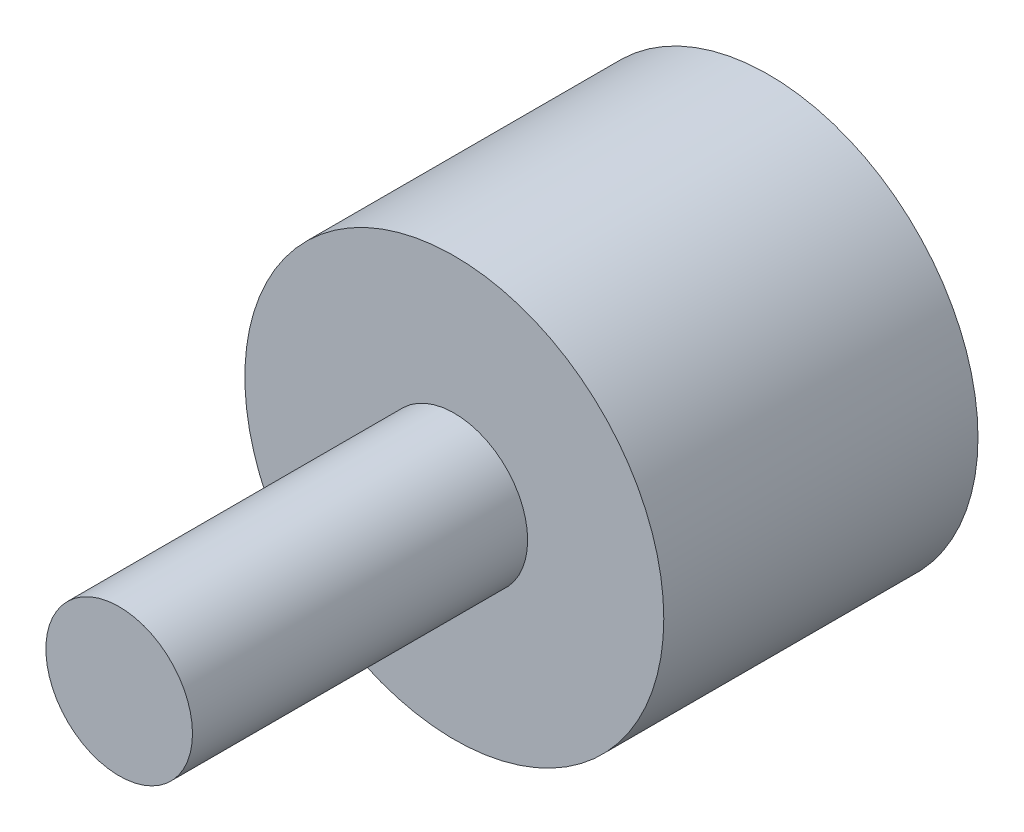
ISO-10303-21;
HEADER;
FILE_DESCRIPTION(('STEP AP214'),'2;1');
FILE_NAME('part.step','',(''),(''),'','','');
FILE_SCHEMA(('AUTOMOTIVE_DESIGN { 1 0 10303 214 1 1 1 1 }'));
ENDSEC;
DATA;
#1=APPLICATION_CONTEXT('core data for automotive mechanical design processes');
#2=APPLICATION_PROTOCOL_DEFINITION('international standard','automotive_design',2000,#1);
#3=PRODUCT_CONTEXT('',#1,'mechanical');
#4=PRODUCT('Part','Part','',(#3));
#5=PRODUCT_RELATED_PRODUCT_CATEGORY('part','',(#4));
#6=PRODUCT_DEFINITION_FORMATION('','',#4);
#7=PRODUCT_DEFINITION_CONTEXT('part definition',#1,'design');
#8=PRODUCT_DEFINITION('design','',#6,#7);
#9=PRODUCT_DEFINITION_SHAPE('','',#8);
#10=(LENGTH_UNIT() NAMED_UNIT(*) SI_UNIT(.MILLI.,.METRE.));
#11=(NAMED_UNIT(*) PLANE_ANGLE_UNIT() SI_UNIT($,.RADIAN.));
#12=(NAMED_UNIT(*) SI_UNIT($,.STERADIAN.) SOLID_ANGLE_UNIT());
#13=UNCERTAINTY_MEASURE_WITH_UNIT(LENGTH_MEASURE(1.E-05),#10,'distance_accuracy_value','');
#14=(GEOMETRIC_REPRESENTATION_CONTEXT(3) GLOBAL_UNCERTAINTY_ASSIGNED_CONTEXT((#13)) GLOBAL_UNIT_ASSIGNED_CONTEXT((#10,
#11,#12)) REPRESENTATION_CONTEXT('',''));
#15=CARTESIAN_POINT('',(0.,0.,0.));
#16=DIRECTION('',(0.,0.,1.));
#17=DIRECTION('',(1.,0.,0.));
#18=AXIS2_PLACEMENT_3D('',#15,#16,#17);
#19=CARTESIAN_POINT('',(0.,0.,15.));
#20=DIRECTION('',(0.,0.,-1.));
#21=DIRECTION('',(-1.,0.,0.));
#22=AXIS2_PLACEMENT_3D('',#19,#20,#21);
#23=CYLINDRICAL_SURFACE('',#22,10.);
#24=CARTESIAN_POINT('',(0.,0.,15.));
#25=DIRECTION('',(0.,0.,1.));
#26=DIRECTION('',(1.,0.,0.));
#27=AXIS2_PLACEMENT_3D('',#24,#25,#26);
#28=CIRCLE('',#27,10.);
#29=CARTESIAN_POINT('',(10.,0.,15.));
#30=VERTEX_POINT('',#29);
#31=EDGE_CURVE('E10',#30,#30,#28,.T.);
#32=ORIENTED_EDGE('',*,*,#31,.F.);
#33=EDGE_LOOP('',(#32));
#34=FACE_BOUND('',#33,.T.);
#35=CARTESIAN_POINT('',(0.,0.,0.));
#36=DIRECTION('',(0.,0.,1.));
#37=DIRECTION('',(1.,0.,0.));
#38=AXIS2_PLACEMENT_3D('',#35,#36,#37);
#39=CIRCLE('',#38,10.);
#40=CARTESIAN_POINT('',(10.,0.,0.));
#41=VERTEX_POINT('',#40);
#42=EDGE_CURVE('E40',#41,#41,#39,.T.);
#43=ORIENTED_EDGE('',*,*,#42,.T.);
#44=EDGE_LOOP('',(#43));
#45=FACE_BOUND('',#44,.T.);
#46=ADVANCED_FACE('F33',(#34,#45),#23,.T.);
#47=CARTESIAN_POINT('',(0.,0.,15.));
#48=DIRECTION('',(0.,0.,1.));
#49=DIRECTION('',(1.,0.,0.));
#50=AXIS2_PLACEMENT_3D('',#47,#48,#49);
#51=PLANE('',#50);
#52=CARTESIAN_POINT('',(0.,0.,15.));
#53=DIRECTION('',(0.,0.,1.));
#54=DIRECTION('',(1.,0.,0.));
#55=AXIS2_PLACEMENT_3D('',#52,#53,#54);
#56=CIRCLE('',#55,3.5);
#57=CARTESIAN_POINT('',(3.5,0.,15.));
#58=VERTEX_POINT('',#57);
#59=EDGE_CURVE('E47',#58,#58,#56,.T.);
#60=ORIENTED_EDGE('',*,*,#59,.F.);
#61=EDGE_LOOP('',(#60));
#62=FACE_BOUND('',#61,.T.);
#63=ORIENTED_EDGE('',*,*,#31,.T.);
#64=EDGE_LOOP('',(#63));
#65=FACE_BOUND('',#64,.T.);
#66=ADVANCED_FACE('F62',(#62,#65),#51,.T.);
#67=CARTESIAN_POINT('',(0.,0.,0.));
#68=DIRECTION('',(0.,0.,1.));
#69=DIRECTION('',(1.,0.,0.));
#70=AXIS2_PLACEMENT_3D('',#67,#68,#69);
#71=PLANE('',#70);
#72=CARTESIAN_POINT('',(0.,0.,0.));
#73=DIRECTION('',(0.,0.,1.));
#74=DIRECTION('',(1.,0.,0.));
#75=AXIS2_PLACEMENT_3D('',#72,#73,#74);
#76=CIRCLE('',#75,5.19615242270663);
#77=CARTESIAN_POINT('',(5.19615242270663,0.,0.));
#78=VERTEX_POINT('',#77);
#79=EDGE_CURVE('E36',#78,#78,#76,.T.);
#80=ORIENTED_EDGE('',*,*,#79,.T.);
#81=EDGE_LOOP('',(#80));
#82=FACE_BOUND('',#81,.T.);
#83=ORIENTED_EDGE('',*,*,#42,.F.);
#84=EDGE_LOOP('',(#83));
#85=FACE_BOUND('',#84,.T.);
#86=ADVANCED_FACE('F58',(#82,#85),#71,.F.);
#87=CARTESIAN_POINT('',(0.,0.,31.));
#88=DIRECTION('',(0.,0.,-1.));
#89=DIRECTION('',(-1.,0.,0.));
#90=AXIS2_PLACEMENT_3D('',#87,#88,#89);
#91=CYLINDRICAL_SURFACE('',#90,3.5);
#92=CARTESIAN_POINT('',(0.,0.,31.));
#93=DIRECTION('',(0.,0.,1.));
#94=DIRECTION('',(1.,0.,0.));
#95=AXIS2_PLACEMENT_3D('',#92,#93,#94);
#96=CIRCLE('',#95,3.5);
#97=CARTESIAN_POINT('',(3.5,0.,31.));
#98=VERTEX_POINT('',#97);
#99=EDGE_CURVE('E45',#98,#98,#96,.T.);
#100=ORIENTED_EDGE('',*,*,#99,.F.);
#101=EDGE_LOOP('',(#100));
#102=FACE_BOUND('',#101,.T.);
#103=ORIENTED_EDGE('',*,*,#59,.T.);
#104=EDGE_LOOP('',(#103));
#105=FACE_BOUND('',#104,.T.);
#106=ADVANCED_FACE('F55',(#102,#105),#91,.T.);
#107=CARTESIAN_POINT('',(0.,0.,31.));
#108=DIRECTION('',(0.,0.,1.));
#109=DIRECTION('',(1.,0.,0.));
#110=AXIS2_PLACEMENT_3D('',#107,#108,#109);
#111=PLANE('',#110);
#112=ORIENTED_EDGE('',*,*,#99,.T.);
#113=EDGE_LOOP('',(#112));
#114=FACE_BOUND('',#113,.T.);
#115=ADVANCED_FACE('F53',(#114),#111,.T.);
#116=CARTESIAN_POINT('',(0.,0.,3.));
#117=DIRECTION('',(0.,0.,1.));
#118=DIRECTION('',(1.,0.,0.));
#119=AXIS2_PLACEMENT_3D('',#116,#117,#118);
#120=SPHERICAL_SURFACE('',#119,6.);
#121=ORIENTED_EDGE('',*,*,#79,.F.);
#122=EDGE_LOOP('',(#121));
#123=FACE_BOUND('',#122,.T.);
#124=ADVANCED_FACE('F74',(#123),#120,.T.);
#125=CLOSED_SHELL('',(#46,#66,#86,#106,#115,#124));
#126=MANIFOLD_SOLID_BREP('B2',#125);
#127=ADVANCED_BREP_SHAPE_REPRESENTATION('',(#18,#126),#14);
#128=SHAPE_DEFINITION_REPRESENTATION(#9,#127);
ENDSEC;
END-ISO-10303-21;
